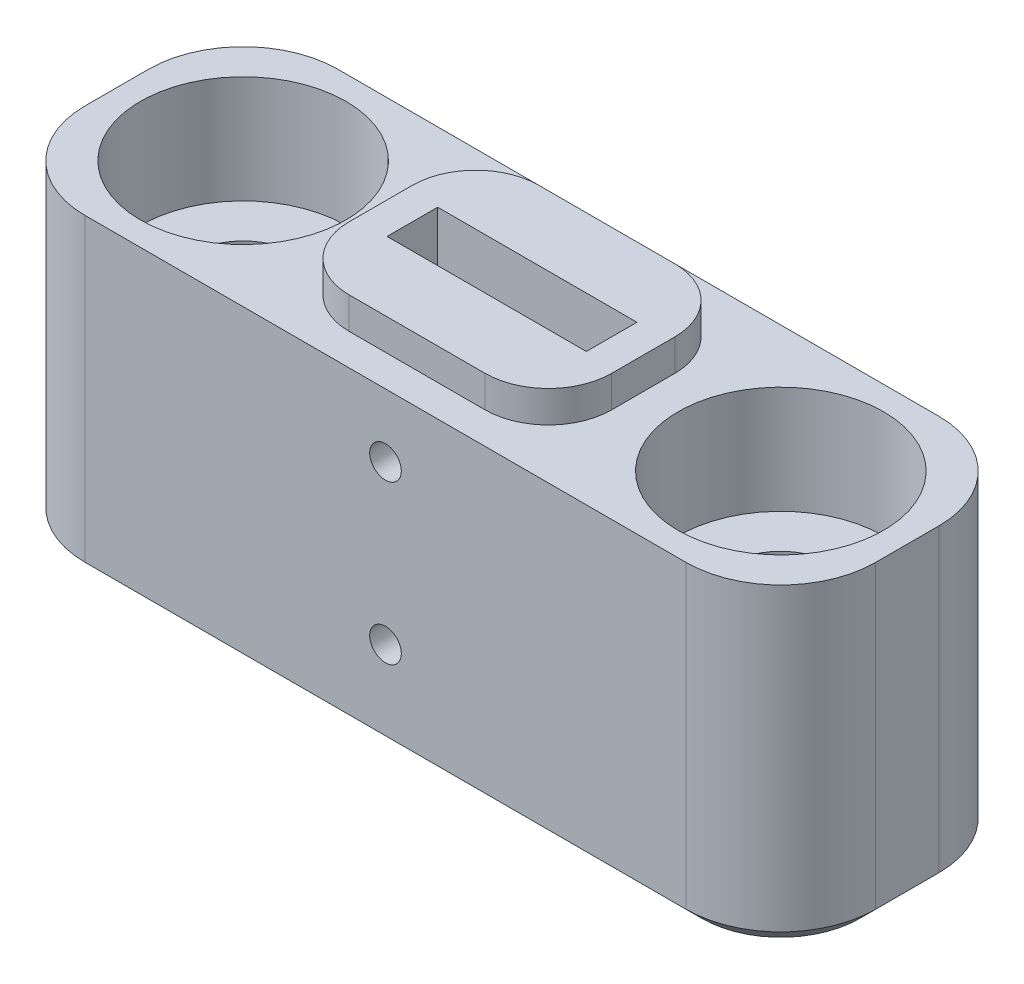
ISO-10303-21;
HEADER;
FILE_DESCRIPTION(('STEP AP214'),'2;1');
FILE_NAME('part.step','',(''),(''),'','','');
FILE_SCHEMA(('AUTOMOTIVE_DESIGN { 1 0 10303 214 1 1 1 1 }'));
ENDSEC;
DATA;
#1=APPLICATION_CONTEXT('core data for automotive mechanical design processes');
#2=APPLICATION_PROTOCOL_DEFINITION('international standard','automotive_design',2000,#1);
#3=PRODUCT_CONTEXT('',#1,'mechanical');
#4=PRODUCT('Part','Part','',(#3));
#5=PRODUCT_RELATED_PRODUCT_CATEGORY('part','',(#4));
#6=PRODUCT_DEFINITION_FORMATION('','',#4);
#7=PRODUCT_DEFINITION_CONTEXT('part definition',#1,'design');
#8=PRODUCT_DEFINITION('design','',#6,#7);
#9=PRODUCT_DEFINITION_SHAPE('','',#8);
#10=(LENGTH_UNIT() NAMED_UNIT(*) SI_UNIT(.MILLI.,.METRE.));
#11=(NAMED_UNIT(*) PLANE_ANGLE_UNIT() SI_UNIT($,.RADIAN.));
#12=(NAMED_UNIT(*) SI_UNIT($,.STERADIAN.) SOLID_ANGLE_UNIT());
#13=UNCERTAINTY_MEASURE_WITH_UNIT(LENGTH_MEASURE(1.E-05),#10,'distance_accuracy_value','');
#14=(GEOMETRIC_REPRESENTATION_CONTEXT(3) GLOBAL_UNCERTAINTY_ASSIGNED_CONTEXT((#13)) GLOBAL_UNIT_ASSIGNED_CONTEXT((#10,
#11,#12)) REPRESENTATION_CONTEXT('',''));
#15=CARTESIAN_POINT('',(0.,0.,0.));
#16=DIRECTION('',(0.,0.,1.));
#17=DIRECTION('',(1.,0.,0.));
#18=AXIS2_PLACEMENT_3D('',#15,#16,#17);
#19=CARTESIAN_POINT('',(12.5,5.,4.));
#20=DIRECTION('',(0.,-1.,0.));
#21=DIRECTION('',(1.,0.,0.));
#22=AXIS2_PLACEMENT_3D('',#19,#20,#21);
#23=PLANE('',#22);
#24=DIRECTION('',(0.,0.,-1.));
#25=VECTOR('',#24,1.);
#26=CARTESIAN_POINT('',(12.5,5.,4.));
#27=LINE('',#26,#25);
#28=CARTESIAN_POINT('',(12.5,5.,1.));
#29=VERTEX_POINT('',#28);
#30=CARTESIAN_POINT('',(12.5,5.,-1.));
#31=VERTEX_POINT('',#30);
#32=EDGE_CURVE('E302',#29,#31,#27,.T.);
#33=ORIENTED_EDGE('',*,*,#32,.T.);
#34=CARTESIAN_POINT('',(9.5,5.,-1.));
#35=DIRECTION('',(0.,-1.,0.));
#36=DIRECTION('',(1.,0.,0.));
#37=AXIS2_PLACEMENT_3D('',#34,#35,#36);
#38=CIRCLE('',#37,3.);
#39=CARTESIAN_POINT('',(9.5,5.,-4.));
#40=VERTEX_POINT('',#39);
#41=EDGE_CURVE('E316',#31,#40,#38,.F.);
#42=ORIENTED_EDGE('',*,*,#41,.T.);
#43=DIRECTION('',(-1.,0.,0.));
#44=VECTOR('',#43,1.);
#45=CARTESIAN_POINT('',(12.5,5.,-4.));
#46=LINE('',#45,#44);
#47=CARTESIAN_POINT('',(-9.5,5.,-4.));
#48=VERTEX_POINT('',#47);
#49=EDGE_CURVE('E293',#40,#48,#46,.T.);
#50=ORIENTED_EDGE('',*,*,#49,.T.);
#51=CARTESIAN_POINT('',(-9.5,5.,-1.));
#52=DIRECTION('',(0.,-1.,0.));
#53=DIRECTION('',(1.,0.,0.));
#54=AXIS2_PLACEMENT_3D('',#51,#52,#53);
#55=CIRCLE('',#54,3.);
#56=CARTESIAN_POINT('',(-12.5,5.,-1.));
#57=VERTEX_POINT('',#56);
#58=EDGE_CURVE('E312',#48,#57,#55,.F.);
#59=ORIENTED_EDGE('',*,*,#58,.T.);
#60=DIRECTION('',(0.,0.,-1.));
#61=VECTOR('',#60,1.);
#62=CARTESIAN_POINT('',(-12.5,5.,4.));
#63=LINE('',#62,#61);
#64=CARTESIAN_POINT('',(-12.5,5.,1.));
#65=VERTEX_POINT('',#64);
#66=EDGE_CURVE('E297',#65,#57,#63,.T.);
#67=ORIENTED_EDGE('',*,*,#66,.F.);
#68=CARTESIAN_POINT('',(-9.5,5.,1.));
#69=DIRECTION('',(0.,-1.,0.));
#70=DIRECTION('',(1.,0.,0.));
#71=AXIS2_PLACEMENT_3D('',#68,#69,#70);
#72=CIRCLE('',#71,3.);
#73=CARTESIAN_POINT('',(-9.5,5.,4.));
#74=VERTEX_POINT('',#73);
#75=EDGE_CURVE('E310',#65,#74,#72,.F.);
#76=ORIENTED_EDGE('',*,*,#75,.T.);
#77=DIRECTION('',(-1.,0.,0.));
#78=VECTOR('',#77,1.);
#79=CARTESIAN_POINT('',(12.5,5.,4.));
#80=LINE('',#79,#78);
#81=CARTESIAN_POINT('',(9.5,5.,4.));
#82=VERTEX_POINT('',#81);
#83=EDGE_CURVE('E294',#82,#74,#80,.T.);
#84=ORIENTED_EDGE('',*,*,#83,.F.);
#85=CARTESIAN_POINT('',(9.5,5.,1.));
#86=DIRECTION('',(0.,-1.,0.));
#87=DIRECTION('',(1.,0.,0.));
#88=AXIS2_PLACEMENT_3D('',#85,#86,#87);
#89=CIRCLE('',#88,3.);
#90=EDGE_CURVE('E314',#82,#29,#89,.F.);
#91=ORIENTED_EDGE('',*,*,#90,.T.);
#92=EDGE_LOOP('',(#33,#42,#50,#59,#67,#76,#84,#91));
#93=FACE_BOUND('',#92,.T.);
#94=CARTESIAN_POINT('',(8.5,5.,0.));
#95=DIRECTION('',(0.,1.,0.));
#96=DIRECTION('',(0.,0.,1.));
#97=AXIS2_PLACEMENT_3D('',#94,#95,#96);
#98=CIRCLE('',#97,3.25);
#99=CARTESIAN_POINT('',(8.5,5.,3.25));
#100=VERTEX_POINT('',#99);
#101=EDGE_CURVE('E281',#100,#100,#98,.T.);
#102=ORIENTED_EDGE('',*,*,#101,.F.);
#103=EDGE_LOOP('',(#102));
#104=FACE_BOUND('',#103,.T.);
#105=CARTESIAN_POINT('',(-8.5,5.,0.));
#106=DIRECTION('',(0.,1.,0.));
#107=DIRECTION('',(0.,0.,1.));
#108=AXIS2_PLACEMENT_3D('',#105,#106,#107);
#109=CIRCLE('',#108,3.25);
#110=CARTESIAN_POINT('',(-8.5,5.,3.24999999999999));
#111=VERTEX_POINT('',#110);
#112=EDGE_CURVE('E269',#111,#111,#109,.T.);
#113=ORIENTED_EDGE('',*,*,#112,.F.);
#114=EDGE_LOOP('',(#113));
#115=FACE_BOUND('',#114,.T.);
#116=DIRECTION('',(0.,0.,1.));
#117=VECTOR('',#116,1.);
#118=CARTESIAN_POINT('',(-4.15,5.,3.));
#119=LINE('',#118,#117);
#120=CARTESIAN_POINT('',(-4.15,5.,-1.));
#121=VERTEX_POINT('',#120);
#122=CARTESIAN_POINT('',(-4.15,5.,1.));
#123=VERTEX_POINT('',#122);
#124=EDGE_CURVE('E234',#121,#123,#119,.T.);
#125=ORIENTED_EDGE('',*,*,#124,.F.);
#126=CARTESIAN_POINT('',(-2.15,5.,-1.));
#127=DIRECTION('',(0.,-1.,0.));
#128=DIRECTION('',(1.,0.,0.));
#129=AXIS2_PLACEMENT_3D('',#126,#127,#128);
#130=CIRCLE('',#129,2.);
#131=CARTESIAN_POINT('',(-2.15,5.,-3.));
#132=VERTEX_POINT('',#131);
#133=EDGE_CURVE('E360',#121,#132,#130,.T.);
#134=ORIENTED_EDGE('',*,*,#133,.T.);
#135=DIRECTION('',(-1.,0.,0.));
#136=VECTOR('',#135,1.);
#137=CARTESIAN_POINT('',(4.15,5.,-3.));
#138=LINE('',#137,#136);
#139=CARTESIAN_POINT('',(2.15,5.,-3.));
#140=VERTEX_POINT('',#139);
#141=EDGE_CURVE('E239',#140,#132,#138,.T.);
#142=ORIENTED_EDGE('',*,*,#141,.F.);
#143=CARTESIAN_POINT('',(2.15,5.,-1.));
#144=DIRECTION('',(0.,-1.,0.));
#145=DIRECTION('',(1.,0.,0.));
#146=AXIS2_PLACEMENT_3D('',#143,#144,#145);
#147=CIRCLE('',#146,2.);
#148=CARTESIAN_POINT('',(4.15,5.,-1.));
#149=VERTEX_POINT('',#148);
#150=EDGE_CURVE('E362',#140,#149,#147,.T.);
#151=ORIENTED_EDGE('',*,*,#150,.T.);
#152=DIRECTION('',(0.,0.,-1.));
#153=VECTOR('',#152,1.);
#154=CARTESIAN_POINT('',(4.15,5.,3.));
#155=LINE('',#154,#153);
#156=CARTESIAN_POINT('',(4.15,5.,1.));
#157=VERTEX_POINT('',#156);
#158=EDGE_CURVE('E254',#157,#149,#155,.T.);
#159=ORIENTED_EDGE('',*,*,#158,.F.);
#160=CARTESIAN_POINT('',(2.15,5.,1.));
#161=DIRECTION('',(0.,-1.,0.));
#162=DIRECTION('',(1.,0.,0.));
#163=AXIS2_PLACEMENT_3D('',#160,#161,#162);
#164=CIRCLE('',#163,2.);
#165=CARTESIAN_POINT('',(2.15,5.,3.));
#166=VERTEX_POINT('',#165);
#167=EDGE_CURVE('E364',#157,#166,#164,.T.);
#168=ORIENTED_EDGE('',*,*,#167,.T.);
#169=DIRECTION('',(1.,0.,0.));
#170=VECTOR('',#169,1.);
#171=CARTESIAN_POINT('',(4.15,5.,3.));
#172=LINE('',#171,#170);
#173=CARTESIAN_POINT('',(-2.15,5.,3.));
#174=VERTEX_POINT('',#173);
#175=EDGE_CURVE('E251',#174,#166,#172,.T.);
#176=ORIENTED_EDGE('',*,*,#175,.F.);
#177=CARTESIAN_POINT('',(-2.15,5.,1.));
#178=DIRECTION('',(0.,-1.,0.));
#179=DIRECTION('',(1.,0.,0.));
#180=AXIS2_PLACEMENT_3D('',#177,#178,#179);
#181=CIRCLE('',#180,2.);
#182=EDGE_CURVE('E366',#174,#123,#181,.T.);
#183=ORIENTED_EDGE('',*,*,#182,.T.);
#184=EDGE_LOOP('',(#125,#134,#142,#151,#159,#168,#176,#183));
#185=FACE_BOUND('',#184,.T.);
#186=ADVANCED_FACE('F38',(#93,#104,#115,#185),#23,.F.);
#187=CARTESIAN_POINT('',(-12.5,-5.,4.));
#188=DIRECTION('',(1.,0.,0.));
#189=DIRECTION('',(0.,0.,-1.));
#190=AXIS2_PLACEMENT_3D('',#187,#188,#189);
#191=PLANE('',#190);
#192=DIRECTION('',(0.,-1.,0.));
#193=VECTOR('',#192,1.);
#194=CARTESIAN_POINT('',(-12.5,-5.,-1.));
#195=LINE('',#194,#193);
#196=CARTESIAN_POINT('',(-12.5,-4.50000000000001,-1.));
#197=VERTEX_POINT('',#196);
#198=EDGE_CURVE('E329',#57,#197,#195,.T.);
#199=ORIENTED_EDGE('',*,*,#198,.T.);
#200=DIRECTION('',(0.,0.,1.));
#201=VECTOR('',#200,1.);
#202=CARTESIAN_POINT('',(-12.5,-4.50000000000001,4.));
#203=LINE('',#202,#201);
#204=CARTESIAN_POINT('',(-12.5,-4.50000000000001,1.));
#205=VERTEX_POINT('',#204);
#206=EDGE_CURVE('E400',#197,#205,#203,.T.);
#207=ORIENTED_EDGE('',*,*,#206,.T.);
#208=DIRECTION('',(0.,-1.,0.));
#209=VECTOR('',#208,1.);
#210=CARTESIAN_POINT('',(-12.5,5.,1.));
#211=LINE('',#210,#209);
#212=EDGE_CURVE('E327',#205,#65,#211,.F.);
#213=ORIENTED_EDGE('',*,*,#212,.T.);
#214=ORIENTED_EDGE('',*,*,#66,.T.);
#215=EDGE_LOOP('',(#199,#207,#213,#214));
#216=FACE_BOUND('',#215,.T.);
#217=ADVANCED_FACE('F467',(#216),#191,.F.);
#218=CARTESIAN_POINT('',(12.5,-5.,4.));
#219=DIRECTION('',(0.,1.,0.));
#220=DIRECTION('',(-1.,0.,0.));
#221=AXIS2_PLACEMENT_3D('',#218,#219,#220);
#222=PLANE('',#221);
#223=CARTESIAN_POINT('',(-9.5,-5.,-1.));
#224=DIRECTION('',(0.,1.,0.));
#225=DIRECTION('',(-1.,0.,0.));
#226=AXIS2_PLACEMENT_3D('',#223,#224,#225);
#227=CIRCLE('',#226,2.5);
#228=CARTESIAN_POINT('',(-12.,-5.,-1.));
#229=VERTEX_POINT('',#228);
#230=CARTESIAN_POINT('',(-9.5,-5.,-3.5));
#231=VERTEX_POINT('',#230);
#232=EDGE_CURVE('E388',#229,#231,#227,.F.);
#233=ORIENTED_EDGE('',*,*,#232,.T.);
#234=DIRECTION('',(1.,0.,0.));
#235=VECTOR('',#234,1.);
#236=CARTESIAN_POINT('',(12.5,-5.,-3.5));
#237=LINE('',#236,#235);
#238=CARTESIAN_POINT('',(9.5,-5.,-3.5));
#239=VERTEX_POINT('',#238);
#240=EDGE_CURVE('E390',#231,#239,#237,.T.);
#241=ORIENTED_EDGE('',*,*,#240,.T.);
#242=CARTESIAN_POINT('',(9.5,-5.,-1.));
#243=DIRECTION('',(0.,1.,0.));
#244=DIRECTION('',(-1.,0.,0.));
#245=AXIS2_PLACEMENT_3D('',#242,#243,#244);
#246=CIRCLE('',#245,2.5);
#247=CARTESIAN_POINT('',(12.,-5.,-1.));
#248=VERTEX_POINT('',#247);
#249=EDGE_CURVE('E386',#239,#248,#246,.F.);
#250=ORIENTED_EDGE('',*,*,#249,.T.);
#251=DIRECTION('',(0.,0.,1.));
#252=VECTOR('',#251,1.);
#253=CARTESIAN_POINT('',(12.,-5.,4.));
#254=LINE('',#253,#252);
#255=CARTESIAN_POINT('',(12.,-5.,1.));
#256=VERTEX_POINT('',#255);
#257=EDGE_CURVE('E382',#248,#256,#254,.T.);
#258=ORIENTED_EDGE('',*,*,#257,.T.);
#259=CARTESIAN_POINT('',(9.5,-5.,1.));
#260=DIRECTION('',(0.,1.,0.));
#261=DIRECTION('',(-1.,0.,0.));
#262=AXIS2_PLACEMENT_3D('',#259,#260,#261);
#263=CIRCLE('',#262,2.5);
#264=CARTESIAN_POINT('',(9.5,-5.,3.5));
#265=VERTEX_POINT('',#264);
#266=EDGE_CURVE('E378',#256,#265,#263,.F.);
#267=ORIENTED_EDGE('',*,*,#266,.T.);
#268=DIRECTION('',(-1.,0.,0.));
#269=VECTOR('',#268,1.);
#270=CARTESIAN_POINT('',(-9.5,-5.,3.5));
#271=LINE('',#270,#269);
#272=CARTESIAN_POINT('',(-9.5,-5.,3.5));
#273=VERTEX_POINT('',#272);
#274=EDGE_CURVE('E368',#265,#273,#271,.T.);
#275=ORIENTED_EDGE('',*,*,#274,.T.);
#276=CARTESIAN_POINT('',(-9.5,-5.,1.));
#277=DIRECTION('',(0.,1.,0.));
#278=DIRECTION('',(-1.,0.,0.));
#279=AXIS2_PLACEMENT_3D('',#276,#277,#278);
#280=CIRCLE('',#279,2.5);
#281=CARTESIAN_POINT('',(-12.,-5.,1.));
#282=VERTEX_POINT('',#281);
#283=EDGE_CURVE('E380',#273,#282,#280,.F.);
#284=ORIENTED_EDGE('',*,*,#283,.T.);
#285=DIRECTION('',(0.,0.,-1.));
#286=VECTOR('',#285,1.);
#287=CARTESIAN_POINT('',(-12.,-5.,4.));
#288=LINE('',#287,#286);
#289=EDGE_CURVE('E384',#282,#229,#288,.T.);
#290=ORIENTED_EDGE('',*,*,#289,.T.);
#291=EDGE_LOOP('',(#233,#241,#250,#258,#267,#275,#284,#290));
#292=FACE_BOUND('',#291,.T.);
#293=CARTESIAN_POINT('',(-8.5,-5.00000000000001,0.));
#294=DIRECTION('',(0.,1.,0.));
#295=DIRECTION('',(0.,0.,1.));
#296=AXIS2_PLACEMENT_3D('',#293,#294,#295);
#297=CIRCLE('',#296,1.7);
#298=CARTESIAN_POINT('',(-8.5,-5.00000000000001,1.7));
#299=VERTEX_POINT('',#298);
#300=EDGE_CURVE('E278',#299,#299,#297,.T.);
#301=ORIENTED_EDGE('',*,*,#300,.T.);
#302=EDGE_LOOP('',(#301));
#303=FACE_BOUND('',#302,.T.);
#304=CARTESIAN_POINT('',(8.5,-5.,0.));
#305=DIRECTION('',(0.,1.,0.));
#306=DIRECTION('',(0.,0.,1.));
#307=AXIS2_PLACEMENT_3D('',#304,#305,#306);
#308=CIRCLE('',#307,1.7);
#309=CARTESIAN_POINT('',(8.5,-5.,1.7));
#310=VERTEX_POINT('',#309);
#311=EDGE_CURVE('E290',#310,#310,#308,.T.);
#312=ORIENTED_EDGE('',*,*,#311,.T.);
#313=EDGE_LOOP('',(#312));
#314=FACE_BOUND('',#313,.T.);
#315=ADVANCED_FACE('F473',(#292,#303,#314),#222,.F.);
#316=CARTESIAN_POINT('',(12.5,-5.,4.));
#317=DIRECTION('',(-1.,0.,0.));
#318=DIRECTION('',(0.,0.,1.));
#319=AXIS2_PLACEMENT_3D('',#316,#317,#318);
#320=PLANE('',#319);
#321=DIRECTION('',(0.,1.,0.));
#322=VECTOR('',#321,1.);
#323=CARTESIAN_POINT('',(12.5,-5.,1.));
#324=LINE('',#323,#322);
#325=CARTESIAN_POINT('',(12.5,-4.50000000000001,1.));
#326=VERTEX_POINT('',#325);
#327=EDGE_CURVE('E305',#29,#326,#324,.F.);
#328=ORIENTED_EDGE('',*,*,#327,.T.);
#329=DIRECTION('',(0.,0.,-1.));
#330=VECTOR('',#329,1.);
#331=CARTESIAN_POINT('',(12.5,-4.50000000000001,4.));
#332=LINE('',#331,#330);
#333=CARTESIAN_POINT('',(12.5,-4.50000000000001,-1.));
#334=VERTEX_POINT('',#333);
#335=EDGE_CURVE('E402',#326,#334,#332,.T.);
#336=ORIENTED_EDGE('',*,*,#335,.T.);
#337=DIRECTION('',(0.,1.,0.));
#338=VECTOR('',#337,1.);
#339=CARTESIAN_POINT('',(12.5,-5.,-1.));
#340=LINE('',#339,#338);
#341=EDGE_CURVE('E308',#334,#31,#340,.T.);
#342=ORIENTED_EDGE('',*,*,#341,.T.);
#343=ORIENTED_EDGE('',*,*,#32,.F.);
#344=EDGE_LOOP('',(#328,#336,#342,#343));
#345=FACE_BOUND('',#344,.T.);
#346=ADVANCED_FACE('F481',(#345),#320,.F.);
#347=CARTESIAN_POINT('',(0.,0.,4.));
#348=DIRECTION('',(0.,0.,1.));
#349=DIRECTION('',(1.,0.,0.));
#350=AXIS2_PLACEMENT_3D('',#347,#348,#349);
#351=PLANE('',#350);
#352=CARTESIAN_POINT('',(0.,3.,4.));
#353=DIRECTION('',(0.,0.,1.));
#354=DIRECTION('',(1.,0.,0.));
#355=AXIS2_PLACEMENT_3D('',#352,#353,#354);
#356=CIRCLE('',#355,0.5);
#357=CARTESIAN_POINT('',(0.5,3.,4.));
#358=VERTEX_POINT('',#357);
#359=EDGE_CURVE('E438',#358,#358,#356,.T.);
#360=ORIENTED_EDGE('',*,*,#359,.F.);
#361=EDGE_LOOP('',(#360));
#362=FACE_BOUND('',#361,.T.);
#363=CARTESIAN_POINT('',(0.,-2.,4.));
#364=DIRECTION('',(0.,0.,1.));
#365=DIRECTION('',(1.,0.,0.));
#366=AXIS2_PLACEMENT_3D('',#363,#364,#365);
#367=CIRCLE('',#366,0.5);
#368=CARTESIAN_POINT('',(0.5,-2.,4.));
#369=VERTEX_POINT('',#368);
#370=EDGE_CURVE('E428',#369,#369,#367,.T.);
#371=ORIENTED_EDGE('',*,*,#370,.F.);
#372=EDGE_LOOP('',(#371));
#373=FACE_BOUND('',#372,.T.);
#374=DIRECTION('',(0.,-1.,0.));
#375=VECTOR('',#374,1.);
#376=CARTESIAN_POINT('',(-9.5,-5.,4.));
#377=LINE('',#376,#375);
#378=CARTESIAN_POINT('',(-9.5,-4.50000000000001,4.));
#379=VERTEX_POINT('',#378);
#380=EDGE_CURVE('E323',#74,#379,#377,.T.);
#381=ORIENTED_EDGE('',*,*,#380,.T.);
#382=DIRECTION('',(1.,0.,0.));
#383=VECTOR('',#382,1.);
#384=CARTESIAN_POINT('',(9.5,-4.50000000000001,4.));
#385=LINE('',#384,#383);
#386=CARTESIAN_POINT('',(9.5,-4.50000000000001,4.));
#387=VERTEX_POINT('',#386);
#388=EDGE_CURVE('E12',#379,#387,#385,.T.);
#389=ORIENTED_EDGE('',*,*,#388,.T.);
#390=DIRECTION('',(0.,1.,0.));
#391=VECTOR('',#390,1.);
#392=CARTESIAN_POINT('',(9.5,5.,4.));
#393=LINE('',#392,#391);
#394=EDGE_CURVE('E325',#387,#82,#393,.T.);
#395=ORIENTED_EDGE('',*,*,#394,.T.);
#396=ORIENTED_EDGE('',*,*,#83,.T.);
#397=EDGE_LOOP('',(#381,#389,#395,#396));
#398=FACE_BOUND('',#397,.T.);
#399=ADVANCED_FACE('F484',(#362,#373,#398),#351,.T.);
#400=CARTESIAN_POINT('',(0.,0.,-4.));
#401=DIRECTION('',(0.,0.,1.));
#402=DIRECTION('',(1.,0.,0.));
#403=AXIS2_PLACEMENT_3D('',#400,#401,#402);
#404=PLANE('',#403);
#405=CARTESIAN_POINT('',(0.,3.,-4.));
#406=DIRECTION('',(0.,0.,1.));
#407=DIRECTION('',(1.,0.,0.));
#408=AXIS2_PLACEMENT_3D('',#405,#406,#407);
#409=CIRCLE('',#408,0.5);
#410=CARTESIAN_POINT('',(0.5,3.,-4.));
#411=VERTEX_POINT('',#410);
#412=EDGE_CURVE('E373',#411,#411,#409,.T.);
#413=ORIENTED_EDGE('',*,*,#412,.T.);
#414=EDGE_LOOP('',(#413));
#415=FACE_BOUND('',#414,.T.);
#416=CARTESIAN_POINT('',(0.,-2.,-4.));
#417=DIRECTION('',(0.,0.,1.));
#418=DIRECTION('',(1.,0.,0.));
#419=AXIS2_PLACEMENT_3D('',#416,#417,#418);
#420=CIRCLE('',#419,0.5);
#421=CARTESIAN_POINT('',(0.5,-2.,-4.));
#422=VERTEX_POINT('',#421);
#423=EDGE_CURVE('E433',#422,#422,#420,.T.);
#424=ORIENTED_EDGE('',*,*,#423,.T.);
#425=EDGE_LOOP('',(#424));
#426=FACE_BOUND('',#425,.T.);
#427=DIRECTION('',(0.,1.,0.));
#428=VECTOR('',#427,1.);
#429=CARTESIAN_POINT('',(9.5,0.,-4.));
#430=LINE('',#429,#428);
#431=CARTESIAN_POINT('',(9.5,-4.50000000000001,-4.));
#432=VERTEX_POINT('',#431);
#433=EDGE_CURVE('E320',#40,#432,#430,.F.);
#434=ORIENTED_EDGE('',*,*,#433,.T.);
#435=DIRECTION('',(-1.,0.,0.));
#436=VECTOR('',#435,1.);
#437=CARTESIAN_POINT('',(0.,-4.50000000000001,-4.));
#438=LINE('',#437,#436);
#439=CARTESIAN_POINT('',(-9.5,-4.50000000000001,-4.));
#440=VERTEX_POINT('',#439);
#441=EDGE_CURVE('E393',#432,#440,#438,.T.);
#442=ORIENTED_EDGE('',*,*,#441,.T.);
#443=DIRECTION('',(0.,-1.,0.));
#444=VECTOR('',#443,1.);
#445=CARTESIAN_POINT('',(-9.5,0.,-4.));
#446=LINE('',#445,#444);
#447=EDGE_CURVE('E318',#440,#48,#446,.F.);
#448=ORIENTED_EDGE('',*,*,#447,.T.);
#449=ORIENTED_EDGE('',*,*,#49,.F.);
#450=EDGE_LOOP('',(#434,#442,#448,#449));
#451=FACE_BOUND('',#450,.T.);
#452=ADVANCED_FACE('F479',(#415,#426,#451),#404,.F.);
#453=CARTESIAN_POINT('',(8.5,5.,0.));
#454=DIRECTION('',(0.,1.,0.));
#455=DIRECTION('',(0.,0.,1.));
#456=AXIS2_PLACEMENT_3D('',#453,#454,#455);
#457=CYLINDRICAL_SURFACE('',#456,1.7);
#458=ORIENTED_EDGE('',*,*,#311,.F.);
#459=EDGE_LOOP('',(#458));
#460=FACE_BOUND('',#459,.T.);
#461=CARTESIAN_POINT('',(8.5,1.6,0.));
#462=DIRECTION('',(0.,1.,0.));
#463=DIRECTION('',(0.,0.,1.));
#464=AXIS2_PLACEMENT_3D('',#461,#462,#463);
#465=CIRCLE('',#464,1.70000000000001);
#466=CARTESIAN_POINT('',(8.5,1.6,1.70000000000001));
#467=VERTEX_POINT('',#466);
#468=EDGE_CURVE('E287',#467,#467,#465,.T.);
#469=ORIENTED_EDGE('',*,*,#468,.T.);
#470=EDGE_LOOP('',(#469));
#471=FACE_BOUND('',#470,.T.);
#472=ADVANCED_FACE('F804',(#460,#471),#457,.F.);
#473=CARTESIAN_POINT('',(10.2,1.6,0.));
#474=DIRECTION('',(0.,-1.,0.));
#475=DIRECTION('',(0.,0.,-1.));
#476=AXIS2_PLACEMENT_3D('',#473,#474,#475);
#477=PLANE('',#476);
#478=ORIENTED_EDGE('',*,*,#468,.F.);
#479=EDGE_LOOP('',(#478));
#480=FACE_BOUND('',#479,.T.);
#481=CARTESIAN_POINT('',(8.5,1.6,0.));
#482=DIRECTION('',(0.,1.,0.));
#483=DIRECTION('',(0.,0.,1.));
#484=AXIS2_PLACEMENT_3D('',#481,#482,#483);
#485=CIRCLE('',#484,3.25);
#486=CARTESIAN_POINT('',(8.5,1.6,3.25));
#487=VERTEX_POINT('',#486);
#488=EDGE_CURVE('E284',#487,#487,#485,.T.);
#489=ORIENTED_EDGE('',*,*,#488,.T.);
#490=EDGE_LOOP('',(#489));
#491=FACE_BOUND('',#490,.T.);
#492=ADVANCED_FACE('F794',(#480,#491),#477,.F.);
#493=CARTESIAN_POINT('',(8.5,5.,0.));
#494=DIRECTION('',(0.,1.,0.));
#495=DIRECTION('',(0.,0.,1.));
#496=AXIS2_PLACEMENT_3D('',#493,#494,#495);
#497=CYLINDRICAL_SURFACE('',#496,3.25);
#498=ORIENTED_EDGE('',*,*,#488,.F.);
#499=EDGE_LOOP('',(#498));
#500=FACE_BOUND('',#499,.T.);
#501=ORIENTED_EDGE('',*,*,#101,.T.);
#502=EDGE_LOOP('',(#501));
#503=FACE_BOUND('',#502,.T.);
#504=ADVANCED_FACE('F784',(#500,#503),#497,.F.);
#505=CARTESIAN_POINT('',(-8.5,5.,0.));
#506=DIRECTION('',(0.,1.,0.));
#507=DIRECTION('',(0.,0.,1.));
#508=AXIS2_PLACEMENT_3D('',#505,#506,#507);
#509=CYLINDRICAL_SURFACE('',#508,1.7);
#510=ORIENTED_EDGE('',*,*,#300,.F.);
#511=EDGE_LOOP('',(#510));
#512=FACE_BOUND('',#511,.T.);
#513=CARTESIAN_POINT('',(-8.5,1.6,0.));
#514=DIRECTION('',(0.,1.,0.));
#515=DIRECTION('',(0.,0.,1.));
#516=AXIS2_PLACEMENT_3D('',#513,#514,#515);
#517=CIRCLE('',#516,1.70000000000001);
#518=CARTESIAN_POINT('',(-8.5,1.6,1.70000000000001));
#519=VERTEX_POINT('',#518);
#520=EDGE_CURVE('E275',#519,#519,#517,.T.);
#521=ORIENTED_EDGE('',*,*,#520,.T.);
#522=EDGE_LOOP('',(#521));
#523=FACE_BOUND('',#522,.T.);
#524=ADVANCED_FACE('F774',(#512,#523),#509,.F.);
#525=CARTESIAN_POINT('',(-6.79999999999999,1.6,0.));
#526=DIRECTION('',(0.,-1.,0.));
#527=DIRECTION('',(0.,0.,-1.));
#528=AXIS2_PLACEMENT_3D('',#525,#526,#527);
#529=PLANE('',#528);
#530=ORIENTED_EDGE('',*,*,#520,.F.);
#531=EDGE_LOOP('',(#530));
#532=FACE_BOUND('',#531,.T.);
#533=CARTESIAN_POINT('',(-8.5,1.6,0.));
#534=DIRECTION('',(0.,1.,0.));
#535=DIRECTION('',(0.,0.,1.));
#536=AXIS2_PLACEMENT_3D('',#533,#534,#535);
#537=CIRCLE('',#536,3.25);
#538=CARTESIAN_POINT('',(-8.5,1.6,3.24999999999999));
#539=VERTEX_POINT('',#538);
#540=EDGE_CURVE('E272',#539,#539,#537,.T.);
#541=ORIENTED_EDGE('',*,*,#540,.T.);
#542=EDGE_LOOP('',(#541));
#543=FACE_BOUND('',#542,.T.);
#544=ADVANCED_FACE('F763',(#532,#543),#529,.F.);
#545=CARTESIAN_POINT('',(-8.5,5.,0.));
#546=DIRECTION('',(0.,1.,0.));
#547=DIRECTION('',(0.,0.,1.));
#548=AXIS2_PLACEMENT_3D('',#545,#546,#547);
#549=CYLINDRICAL_SURFACE('',#548,3.25);
#550=ORIENTED_EDGE('',*,*,#540,.F.);
#551=EDGE_LOOP('',(#550));
#552=FACE_BOUND('',#551,.T.);
#553=ORIENTED_EDGE('',*,*,#112,.T.);
#554=EDGE_LOOP('',(#553));
#555=FACE_BOUND('',#554,.T.);
#556=ADVANCED_FACE('F493',(#552,#555),#549,.F.);
#557=CARTESIAN_POINT('',(9.5,-5.,-1.));
#558=DIRECTION('',(0.,1.,0.));
#559=DIRECTION('',(0.,0.,1.));
#560=AXIS2_PLACEMENT_3D('',#557,#558,#559);
#561=CYLINDRICAL_SURFACE('',#560,3.);
#562=ORIENTED_EDGE('',*,*,#341,.F.);
#563=CARTESIAN_POINT('',(9.5,-4.50000000000001,-1.));
#564=DIRECTION('',(0.,1.,0.));
#565=DIRECTION('',(0.,0.,1.));
#566=AXIS2_PLACEMENT_3D('',#563,#564,#565);
#567=CIRCLE('',#566,3.);
#568=EDGE_CURVE('E398',#334,#432,#567,.T.);
#569=ORIENTED_EDGE('',*,*,#568,.T.);
#570=ORIENTED_EDGE('',*,*,#433,.F.);
#571=ORIENTED_EDGE('',*,*,#41,.F.);
#572=EDGE_LOOP('',(#562,#569,#570,#571));
#573=FACE_BOUND('',#572,.T.);
#574=ADVANCED_FACE('F489',(#573),#561,.T.);
#575=CARTESIAN_POINT('',(9.5,0.,1.));
#576=DIRECTION('',(0.,-1.,0.));
#577=DIRECTION('',(0.,0.,-1.));
#578=AXIS2_PLACEMENT_3D('',#575,#576,#577);
#579=CYLINDRICAL_SURFACE('',#578,3.);
#580=ORIENTED_EDGE('',*,*,#394,.F.);
#581=CARTESIAN_POINT('',(9.5,-4.50000000000001,1.));
#582=DIRECTION('',(0.,1.,0.));
#583=DIRECTION('',(0.,0.,1.));
#584=AXIS2_PLACEMENT_3D('',#581,#582,#583);
#585=CIRCLE('',#584,3.);
#586=EDGE_CURVE('E48',#387,#326,#585,.T.);
#587=ORIENTED_EDGE('',*,*,#586,.T.);
#588=ORIENTED_EDGE('',*,*,#327,.F.);
#589=ORIENTED_EDGE('',*,*,#90,.F.);
#590=EDGE_LOOP('',(#580,#587,#588,#589));
#591=FACE_BOUND('',#590,.T.);
#592=ADVANCED_FACE('F492',(#591),#579,.T.);
#593=CARTESIAN_POINT('',(-9.5,-5.,-1.));
#594=DIRECTION('',(0.,-1.,0.));
#595=DIRECTION('',(0.,0.,-1.));
#596=AXIS2_PLACEMENT_3D('',#593,#594,#595);
#597=CYLINDRICAL_SURFACE('',#596,3.);
#598=ORIENTED_EDGE('',*,*,#447,.F.);
#599=CARTESIAN_POINT('',(-9.5,-4.50000000000001,-1.));
#600=DIRECTION('',(0.,1.,0.));
#601=DIRECTION('',(0.,0.,1.));
#602=AXIS2_PLACEMENT_3D('',#599,#600,#601);
#603=CIRCLE('',#602,3.);
#604=EDGE_CURVE('E396',#440,#197,#603,.T.);
#605=ORIENTED_EDGE('',*,*,#604,.T.);
#606=ORIENTED_EDGE('',*,*,#198,.F.);
#607=ORIENTED_EDGE('',*,*,#58,.F.);
#608=EDGE_LOOP('',(#598,#605,#606,#607));
#609=FACE_BOUND('',#608,.T.);
#610=ADVANCED_FACE('F497',(#609),#597,.T.);
#611=CARTESIAN_POINT('',(-9.5,0.,1.));
#612=DIRECTION('',(0.,1.,0.));
#613=DIRECTION('',(0.,0.,1.));
#614=AXIS2_PLACEMENT_3D('',#611,#612,#613);
#615=CYLINDRICAL_SURFACE('',#614,3.);
#616=ORIENTED_EDGE('',*,*,#212,.F.);
#617=CARTESIAN_POINT('',(-9.5,-4.50000000000001,1.));
#618=DIRECTION('',(0.,1.,0.));
#619=DIRECTION('',(0.,0.,1.));
#620=AXIS2_PLACEMENT_3D('',#617,#618,#619);
#621=CIRCLE('',#620,3.);
#622=EDGE_CURVE('E62',#205,#379,#621,.T.);
#623=ORIENTED_EDGE('',*,*,#622,.T.);
#624=ORIENTED_EDGE('',*,*,#380,.F.);
#625=ORIENTED_EDGE('',*,*,#75,.F.);
#626=EDGE_LOOP('',(#616,#623,#624,#625));
#627=FACE_BOUND('',#626,.T.);
#628=ADVANCED_FACE('F501',(#627),#615,.T.);
#629=CARTESIAN_POINT('',(0.,6.,0.));
#630=DIRECTION('',(0.,1.,0.));
#631=DIRECTION('',(0.,0.,1.));
#632=AXIS2_PLACEMENT_3D('',#629,#630,#631);
#633=PLANE('',#632);
#634=DIRECTION('',(-1.,0.,0.));
#635=VECTOR('',#634,1.);
#636=CARTESIAN_POINT('',(4.15,6.,-3.));
#637=LINE('',#636,#635);
#638=CARTESIAN_POINT('',(2.15,6.,-3.));
#639=VERTEX_POINT('',#638);
#640=CARTESIAN_POINT('',(-2.15,6.,-3.));
#641=VERTEX_POINT('',#640);
#642=EDGE_CURVE('E245',#639,#641,#637,.T.);
#643=ORIENTED_EDGE('',*,*,#642,.T.);
#644=CARTESIAN_POINT('',(-2.15,6.,-1.));
#645=DIRECTION('',(0.,1.,0.));
#646=DIRECTION('',(0.,0.,1.));
#647=AXIS2_PLACEMENT_3D('',#644,#645,#646);
#648=CIRCLE('',#647,2.);
#649=CARTESIAN_POINT('',(-4.15,6.,-1.));
#650=VERTEX_POINT('',#649);
#651=EDGE_CURVE('E348',#641,#650,#648,.T.);
#652=ORIENTED_EDGE('',*,*,#651,.T.);
#653=DIRECTION('',(0.,0.,1.));
#654=VECTOR('',#653,1.);
#655=CARTESIAN_POINT('',(-4.15,6.,3.));
#656=LINE('',#655,#654);
#657=CARTESIAN_POINT('',(-4.15,6.,1.));
#658=VERTEX_POINT('',#657);
#659=EDGE_CURVE('E235',#650,#658,#656,.T.);
#660=ORIENTED_EDGE('',*,*,#659,.T.);
#661=CARTESIAN_POINT('',(-2.15,6.,1.));
#662=DIRECTION('',(0.,1.,0.));
#663=DIRECTION('',(0.,0.,1.));
#664=AXIS2_PLACEMENT_3D('',#661,#662,#663);
#665=CIRCLE('',#664,2.);
#666=CARTESIAN_POINT('',(-2.15,6.,3.));
#667=VERTEX_POINT('',#666);
#668=EDGE_CURVE('E342',#658,#667,#665,.T.);
#669=ORIENTED_EDGE('',*,*,#668,.T.);
#670=DIRECTION('',(1.,0.,0.));
#671=VECTOR('',#670,1.);
#672=CARTESIAN_POINT('',(4.15,6.,3.));
#673=LINE('',#672,#671);
#674=CARTESIAN_POINT('',(2.15,6.,3.));
#675=VERTEX_POINT('',#674);
#676=EDGE_CURVE('E238',#667,#675,#673,.T.);
#677=ORIENTED_EDGE('',*,*,#676,.T.);
#678=CARTESIAN_POINT('',(2.15,6.,1.));
#679=DIRECTION('',(0.,1.,0.));
#680=DIRECTION('',(0.,0.,1.));
#681=AXIS2_PLACEMENT_3D('',#678,#679,#680);
#682=CIRCLE('',#681,2.);
#683=CARTESIAN_POINT('',(4.15,6.,1.));
#684=VERTEX_POINT('',#683);
#685=EDGE_CURVE('E344',#675,#684,#682,.T.);
#686=ORIENTED_EDGE('',*,*,#685,.T.);
#687=DIRECTION('',(0.,0.,-1.));
#688=VECTOR('',#687,1.);
#689=CARTESIAN_POINT('',(4.15,6.,3.));
#690=LINE('',#689,#688);
#691=CARTESIAN_POINT('',(4.15,6.,-1.));
#692=VERTEX_POINT('',#691);
#693=EDGE_CURVE('E242',#684,#692,#690,.T.);
#694=ORIENTED_EDGE('',*,*,#693,.T.);
#695=CARTESIAN_POINT('',(2.15,6.,-1.));
#696=DIRECTION('',(0.,1.,0.));
#697=DIRECTION('',(0.,0.,1.));
#698=AXIS2_PLACEMENT_3D('',#695,#696,#697);
#699=CIRCLE('',#698,2.);
#700=EDGE_CURVE('E346',#692,#639,#699,.T.);
#701=ORIENTED_EDGE('',*,*,#700,.T.);
#702=EDGE_LOOP('',(#643,#652,#660,#669,#677,#686,#694,#701));
#703=FACE_BOUND('',#702,.T.);
#704=DIRECTION('',(0.,0.,1.));
#705=VECTOR('',#704,1.);
#706=CARTESIAN_POINT('',(-3.15,6.,-0.8));
#707=LINE('',#706,#705);
#708=CARTESIAN_POINT('',(-3.15,6.,-0.8));
#709=VERTEX_POINT('',#708);
#710=CARTESIAN_POINT('',(-3.15,6.,0.8));
#711=VERTEX_POINT('',#710);
#712=EDGE_CURVE('E207',#709,#711,#707,.T.);
#713=ORIENTED_EDGE('',*,*,#712,.F.);
#714=DIRECTION('',(-1.,0.,0.));
#715=VECTOR('',#714,1.);
#716=CARTESIAN_POINT('',(-3.15,6.,-0.8));
#717=LINE('',#716,#715);
#718=CARTESIAN_POINT('',(3.15,6.,-0.800000000000001));
#719=VERTEX_POINT('',#718);
#720=EDGE_CURVE('E217',#719,#709,#717,.T.);
#721=ORIENTED_EDGE('',*,*,#720,.F.);
#722=DIRECTION('',(0.,0.,-1.));
#723=VECTOR('',#722,1.);
#724=CARTESIAN_POINT('',(3.15,6.,-0.800000000000001));
#725=LINE('',#724,#723);
#726=CARTESIAN_POINT('',(3.15,6.,0.799999999999999));
#727=VERTEX_POINT('',#726);
#728=EDGE_CURVE('E229',#727,#719,#725,.T.);
#729=ORIENTED_EDGE('',*,*,#728,.F.);
#730=DIRECTION('',(1.,0.,0.));
#731=VECTOR('',#730,1.);
#732=CARTESIAN_POINT('',(-3.15,6.,0.8));
#733=LINE('',#732,#731);
#734=EDGE_CURVE('E227',#711,#727,#733,.T.);
#735=ORIENTED_EDGE('',*,*,#734,.F.);
#736=EDGE_LOOP('',(#713,#721,#729,#735));
#737=FACE_BOUND('',#736,.T.);
#738=ADVANCED_FACE('F225',(#703,#737),#633,.T.);
#739=CARTESIAN_POINT('',(-4.15,6.,3.));
#740=DIRECTION('',(1.,0.,0.));
#741=DIRECTION('',(0.,1.,0.));
#742=AXIS2_PLACEMENT_3D('',#739,#740,#741);
#743=PLANE('',#742);
#744=ORIENTED_EDGE('',*,*,#659,.F.);
#745=DIRECTION('',(0.,-1.,0.));
#746=VECTOR('',#745,1.);
#747=CARTESIAN_POINT('',(-4.15,6.,-1.));
#748=LINE('',#747,#746);
#749=EDGE_CURVE('E334',#650,#121,#748,.T.);
#750=ORIENTED_EDGE('',*,*,#749,.T.);
#751=ORIENTED_EDGE('',*,*,#124,.T.);
#752=DIRECTION('',(0.,-1.,0.));
#753=VECTOR('',#752,1.);
#754=CARTESIAN_POINT('',(-4.15,6.,1.));
#755=LINE('',#754,#753);
#756=EDGE_CURVE('E332',#123,#658,#755,.F.);
#757=ORIENTED_EDGE('',*,*,#756,.T.);
#758=EDGE_LOOP('',(#744,#750,#751,#757));
#759=FACE_BOUND('',#758,.T.);
#760=ADVANCED_FACE('F728',(#759),#743,.F.);
#761=CARTESIAN_POINT('',(4.15,6.,3.));
#762=DIRECTION('',(0.,0.,-1.));
#763=DIRECTION('',(-1.,0.,0.));
#764=AXIS2_PLACEMENT_3D('',#761,#762,#763);
#765=PLANE('',#764);
#766=ORIENTED_EDGE('',*,*,#175,.T.);
#767=DIRECTION('',(0.,-1.,0.));
#768=VECTOR('',#767,1.);
#769=CARTESIAN_POINT('',(2.15,6.,3.));
#770=LINE('',#769,#768);
#771=EDGE_CURVE('E358',#166,#675,#770,.F.);
#772=ORIENTED_EDGE('',*,*,#771,.T.);
#773=ORIENTED_EDGE('',*,*,#676,.F.);
#774=DIRECTION('',(0.,-1.,0.));
#775=VECTOR('',#774,1.);
#776=CARTESIAN_POINT('',(-2.15,6.,3.));
#777=LINE('',#776,#775);
#778=EDGE_CURVE('E355',#667,#174,#777,.T.);
#779=ORIENTED_EDGE('',*,*,#778,.T.);
#780=EDGE_LOOP('',(#766,#772,#773,#779));
#781=FACE_BOUND('',#780,.T.);
#782=ADVANCED_FACE('F719',(#781),#765,.F.);
#783=CARTESIAN_POINT('',(4.15,6.,3.));
#784=DIRECTION('',(-1.,0.,0.));
#785=DIRECTION('',(0.,-1.,0.));
#786=AXIS2_PLACEMENT_3D('',#783,#784,#785);
#787=PLANE('',#786);
#788=ORIENTED_EDGE('',*,*,#158,.T.);
#789=DIRECTION('',(0.,-1.,0.));
#790=VECTOR('',#789,1.);
#791=CARTESIAN_POINT('',(4.15,6.,-1.));
#792=LINE('',#791,#790);
#793=EDGE_CURVE('E353',#149,#692,#792,.F.);
#794=ORIENTED_EDGE('',*,*,#793,.T.);
#795=ORIENTED_EDGE('',*,*,#693,.F.);
#796=DIRECTION('',(0.,-1.,0.));
#797=VECTOR('',#796,1.);
#798=CARTESIAN_POINT('',(4.15,6.,1.));
#799=LINE('',#798,#797);
#800=EDGE_CURVE('E350',#684,#157,#799,.T.);
#801=ORIENTED_EDGE('',*,*,#800,.T.);
#802=EDGE_LOOP('',(#788,#794,#795,#801));
#803=FACE_BOUND('',#802,.T.);
#804=ADVANCED_FACE('F710',(#803),#787,.F.);
#805=CARTESIAN_POINT('',(4.15,6.,-3.));
#806=DIRECTION('',(0.,0.,1.));
#807=DIRECTION('',(1.,0.,0.));
#808=AXIS2_PLACEMENT_3D('',#805,#806,#807);
#809=PLANE('',#808);
#810=ORIENTED_EDGE('',*,*,#141,.T.);
#811=DIRECTION('',(0.,-1.,0.));
#812=VECTOR('',#811,1.);
#813=CARTESIAN_POINT('',(-2.15,6.,-3.));
#814=LINE('',#813,#812);
#815=EDGE_CURVE('E340',#132,#641,#814,.F.);
#816=ORIENTED_EDGE('',*,*,#815,.T.);
#817=ORIENTED_EDGE('',*,*,#642,.F.);
#818=DIRECTION('',(0.,-1.,0.));
#819=VECTOR('',#818,1.);
#820=CARTESIAN_POINT('',(2.15,6.,-3.));
#821=LINE('',#820,#819);
#822=EDGE_CURVE('E337',#639,#140,#821,.T.);
#823=ORIENTED_EDGE('',*,*,#822,.T.);
#824=EDGE_LOOP('',(#810,#816,#817,#823));
#825=FACE_BOUND('',#824,.T.);
#826=ADVANCED_FACE('F705',(#825),#809,.F.);
#827=CARTESIAN_POINT('',(12.5,-3.,4.));
#828=DIRECTION('',(0.,1.,0.));
#829=DIRECTION('',(-1.,0.,0.));
#830=AXIS2_PLACEMENT_3D('',#827,#828,#829);
#831=PLANE('',#830);
#832=DIRECTION('',(0.,0.,-1.));
#833=VECTOR('',#832,1.);
#834=CARTESIAN_POINT('',(-3.15,-3.,0.8));
#835=LINE('',#834,#833);
#836=CARTESIAN_POINT('',(-3.15,-3.,0.8));
#837=VERTEX_POINT('',#836);
#838=CARTESIAN_POINT('',(-3.15,-3.,-0.8));
#839=VERTEX_POINT('',#838);
#840=EDGE_CURVE('E210',#837,#839,#835,.T.);
#841=ORIENTED_EDGE('',*,*,#840,.F.);
#842=DIRECTION('',(-1.,0.,0.));
#843=VECTOR('',#842,1.);
#844=CARTESIAN_POINT('',(3.15,-3.,0.799999999999999));
#845=LINE('',#844,#843);
#846=CARTESIAN_POINT('',(3.15,-3.,0.799999999999999));
#847=VERTEX_POINT('',#846);
#848=EDGE_CURVE('E262',#847,#837,#845,.T.);
#849=ORIENTED_EDGE('',*,*,#848,.F.);
#850=DIRECTION('',(0.,0.,1.));
#851=VECTOR('',#850,1.);
#852=CARTESIAN_POINT('',(3.15,-3.,0.799999999999999));
#853=LINE('',#852,#851);
#854=CARTESIAN_POINT('',(3.15,-3.,-0.800000000000001));
#855=VERTEX_POINT('',#854);
#856=EDGE_CURVE('E213',#855,#847,#853,.T.);
#857=ORIENTED_EDGE('',*,*,#856,.F.);
#858=DIRECTION('',(1.,0.,0.));
#859=VECTOR('',#858,1.);
#860=CARTESIAN_POINT('',(3.15,-3.,-0.800000000000001));
#861=LINE('',#860,#859);
#862=EDGE_CURVE('E260',#839,#855,#861,.T.);
#863=ORIENTED_EDGE('',*,*,#862,.F.);
#864=EDGE_LOOP('',(#841,#849,#857,#863));
#865=FACE_BOUND('',#864,.T.);
#866=ADVANCED_FACE('F698',(#865),#831,.T.);
#867=CARTESIAN_POINT('',(3.15,-11.5,0.799999999999999));
#868=DIRECTION('',(1.,0.,0.));
#869=DIRECTION('',(0.,1.,0.));
#870=AXIS2_PLACEMENT_3D('',#867,#868,#869);
#871=PLANE('',#870);
#872=ORIENTED_EDGE('',*,*,#856,.T.);
#873=DIRECTION('',(0.,1.,0.));
#874=VECTOR('',#873,1.);
#875=CARTESIAN_POINT('',(3.15,-11.5,0.799999999999999));
#876=LINE('',#875,#874);
#877=EDGE_CURVE('E265',#847,#727,#876,.T.);
#878=ORIENTED_EDGE('',*,*,#877,.T.);
#879=ORIENTED_EDGE('',*,*,#728,.T.);
#880=DIRECTION('',(0.,1.,0.));
#881=VECTOR('',#880,1.);
#882=CARTESIAN_POINT('',(3.15,-11.5,-0.800000000000001));
#883=LINE('',#882,#881);
#884=EDGE_CURVE('E214',#855,#719,#883,.T.);
#885=ORIENTED_EDGE('',*,*,#884,.F.);
#886=EDGE_LOOP('',(#872,#878,#879,#885));
#887=FACE_BOUND('',#886,.T.);
#888=ADVANCED_FACE('F689',(#887),#871,.F.);
#889=CARTESIAN_POINT('',(3.15,-11.5,-0.800000000000001));
#890=DIRECTION('',(0.,0.,-1.));
#891=DIRECTION('',(-1.,0.,0.));
#892=AXIS2_PLACEMENT_3D('',#889,#890,#891);
#893=PLANE('',#892);
#894=CARTESIAN_POINT('',(0.,3.,-0.8));
#895=DIRECTION('',(0.,0.,-1.));
#896=DIRECTION('',(-1.,0.,0.));
#897=AXIS2_PLACEMENT_3D('',#894,#895,#896);
#898=CIRCLE('',#897,0.5);
#899=CARTESIAN_POINT('',(-0.5,3.,-0.8));
#900=VERTEX_POINT('',#899);
#901=EDGE_CURVE('E223',#900,#900,#898,.T.);
#902=ORIENTED_EDGE('',*,*,#901,.T.);
#903=EDGE_LOOP('',(#902));
#904=FACE_BOUND('',#903,.T.);
#905=CARTESIAN_POINT('',(0.,-2.,-0.8));
#906=DIRECTION('',(0.,0.,-1.));
#907=DIRECTION('',(-1.,0.,0.));
#908=AXIS2_PLACEMENT_3D('',#905,#906,#907);
#909=CIRCLE('',#908,0.5);
#910=CARTESIAN_POINT('',(-0.5,-2.,-0.8));
#911=VERTEX_POINT('',#910);
#912=EDGE_CURVE('E372',#911,#911,#909,.T.);
#913=ORIENTED_EDGE('',*,*,#912,.T.);
#914=EDGE_LOOP('',(#913));
#915=FACE_BOUND('',#914,.T.);
#916=ORIENTED_EDGE('',*,*,#862,.T.);
#917=ORIENTED_EDGE('',*,*,#884,.T.);
#918=ORIENTED_EDGE('',*,*,#720,.T.);
#919=DIRECTION('',(0.,1.,0.));
#920=VECTOR('',#919,1.);
#921=CARTESIAN_POINT('',(-3.15,-11.5,-0.8));
#922=LINE('',#921,#920);
#923=EDGE_CURVE('E202',#839,#709,#922,.T.);
#924=ORIENTED_EDGE('',*,*,#923,.F.);
#925=EDGE_LOOP('',(#916,#917,#918,#924));
#926=FACE_BOUND('',#925,.T.);
#927=ADVANCED_FACE('F218',(#904,#915,#926),#893,.F.);
#928=CARTESIAN_POINT('',(-3.15,-11.5,0.8));
#929=DIRECTION('',(-1.,0.,0.));
#930=DIRECTION('',(0.,-1.,0.));
#931=AXIS2_PLACEMENT_3D('',#928,#929,#930);
#932=PLANE('',#931);
#933=ORIENTED_EDGE('',*,*,#840,.T.);
#934=ORIENTED_EDGE('',*,*,#923,.T.);
#935=ORIENTED_EDGE('',*,*,#712,.T.);
#936=DIRECTION('',(0.,1.,0.));
#937=VECTOR('',#936,1.);
#938=CARTESIAN_POINT('',(-3.15,-11.5,0.8));
#939=LINE('',#938,#937);
#940=EDGE_CURVE('E248',#837,#711,#939,.T.);
#941=ORIENTED_EDGE('',*,*,#940,.F.);
#942=EDGE_LOOP('',(#933,#934,#935,#941));
#943=FACE_BOUND('',#942,.T.);
#944=ADVANCED_FACE('F204',(#943),#932,.F.);
#945=CARTESIAN_POINT('',(3.15,-11.5,0.799999999999999));
#946=DIRECTION('',(0.,0.,1.));
#947=DIRECTION('',(1.,0.,0.));
#948=AXIS2_PLACEMENT_3D('',#945,#946,#947);
#949=PLANE('',#948);
#950=CARTESIAN_POINT('',(0.,3.,0.799999999999999));
#951=DIRECTION('',(0.,0.,1.));
#952=DIRECTION('',(1.,0.,0.));
#953=AXIS2_PLACEMENT_3D('',#950,#951,#952);
#954=CIRCLE('',#953,0.5);
#955=CARTESIAN_POINT('',(0.5,3.,0.799999999999999));
#956=VERTEX_POINT('',#955);
#957=EDGE_CURVE('E374',#956,#956,#954,.T.);
#958=ORIENTED_EDGE('',*,*,#957,.T.);
#959=EDGE_LOOP('',(#958));
#960=FACE_BOUND('',#959,.T.);
#961=CARTESIAN_POINT('',(0.,-2.,0.799999999999999));
#962=DIRECTION('',(0.,0.,1.));
#963=DIRECTION('',(1.,0.,0.));
#964=AXIS2_PLACEMENT_3D('',#961,#962,#963);
#965=CIRCLE('',#964,0.5);
#966=CARTESIAN_POINT('',(0.5,-2.,0.799999999999999));
#967=VERTEX_POINT('',#966);
#968=EDGE_CURVE('E369',#967,#967,#965,.T.);
#969=ORIENTED_EDGE('',*,*,#968,.T.);
#970=EDGE_LOOP('',(#969));
#971=FACE_BOUND('',#970,.T.);
#972=ORIENTED_EDGE('',*,*,#848,.T.);
#973=ORIENTED_EDGE('',*,*,#940,.T.);
#974=ORIENTED_EDGE('',*,*,#734,.T.);
#975=ORIENTED_EDGE('',*,*,#877,.F.);
#976=EDGE_LOOP('',(#972,#973,#974,#975));
#977=FACE_BOUND('',#976,.T.);
#978=ADVANCED_FACE('F509',(#960,#971,#977),#949,.F.);
#979=CARTESIAN_POINT('',(-2.15,6.,-1.));
#980=DIRECTION('',(0.,-1.,0.));
#981=DIRECTION('',(1.,0.,0.));
#982=AXIS2_PLACEMENT_3D('',#979,#980,#981);
#983=CYLINDRICAL_SURFACE('',#982,2.);
#984=ORIENTED_EDGE('',*,*,#651,.F.);
#985=ORIENTED_EDGE('',*,*,#815,.F.);
#986=ORIENTED_EDGE('',*,*,#133,.F.);
#987=ORIENTED_EDGE('',*,*,#749,.F.);
#988=EDGE_LOOP('',(#984,#985,#986,#987));
#989=FACE_BOUND('',#988,.T.);
#990=ADVANCED_FACE('F505',(#989),#983,.T.);
#991=CARTESIAN_POINT('',(2.15,6.,-1.));
#992=DIRECTION('',(0.,-1.,0.));
#993=DIRECTION('',(1.,0.,0.));
#994=AXIS2_PLACEMENT_3D('',#991,#992,#993);
#995=CYLINDRICAL_SURFACE('',#994,2.);
#996=ORIENTED_EDGE('',*,*,#700,.F.);
#997=ORIENTED_EDGE('',*,*,#793,.F.);
#998=ORIENTED_EDGE('',*,*,#150,.F.);
#999=ORIENTED_EDGE('',*,*,#822,.F.);
#1000=EDGE_LOOP('',(#996,#997,#998,#999));
#1001=FACE_BOUND('',#1000,.T.);
#1002=ADVANCED_FACE('F508',(#1001),#995,.T.);
#1003=CARTESIAN_POINT('',(2.15,6.,1.));
#1004=DIRECTION('',(0.,-1.,0.));
#1005=DIRECTION('',(1.,0.,0.));
#1006=AXIS2_PLACEMENT_3D('',#1003,#1004,#1005);
#1007=CYLINDRICAL_SURFACE('',#1006,2.);
#1008=ORIENTED_EDGE('',*,*,#685,.F.);
#1009=ORIENTED_EDGE('',*,*,#771,.F.);
#1010=ORIENTED_EDGE('',*,*,#167,.F.);
#1011=ORIENTED_EDGE('',*,*,#800,.F.);
#1012=EDGE_LOOP('',(#1008,#1009,#1010,#1011));
#1013=FACE_BOUND('',#1012,.T.);
#1014=ADVANCED_FACE('F513',(#1013),#1007,.T.);
#1015=CARTESIAN_POINT('',(-2.15,6.,1.));
#1016=DIRECTION('',(0.,-1.,0.));
#1017=DIRECTION('',(1.,0.,0.));
#1018=AXIS2_PLACEMENT_3D('',#1015,#1016,#1017);
#1019=CYLINDRICAL_SURFACE('',#1018,2.);
#1020=ORIENTED_EDGE('',*,*,#668,.F.);
#1021=ORIENTED_EDGE('',*,*,#756,.F.);
#1022=ORIENTED_EDGE('',*,*,#182,.F.);
#1023=ORIENTED_EDGE('',*,*,#778,.F.);
#1024=EDGE_LOOP('',(#1020,#1021,#1022,#1023));
#1025=FACE_BOUND('',#1024,.T.);
#1026=ADVANCED_FACE('F517',(#1025),#1019,.T.);
#1027=CARTESIAN_POINT('',(0.,-2.,-4.));
#1028=DIRECTION('',(0.,0.,1.));
#1029=DIRECTION('',(1.,0.,0.));
#1030=AXIS2_PLACEMENT_3D('',#1027,#1028,#1029);
#1031=CYLINDRICAL_SURFACE('',#1030,0.5);
#1032=ORIENTED_EDGE('',*,*,#370,.T.);
#1033=EDGE_LOOP('',(#1032));
#1034=FACE_BOUND('',#1033,.T.);
#1035=ORIENTED_EDGE('',*,*,#968,.F.);
#1036=EDGE_LOOP('',(#1035));
#1037=FACE_BOUND('',#1036,.T.);
#1038=ADVANCED_FACE('F462',(#1034,#1037),#1031,.F.);
#1039=CARTESIAN_POINT('',(0.,3.,-4.));
#1040=DIRECTION('',(0.,0.,1.));
#1041=DIRECTION('',(1.,0.,0.));
#1042=AXIS2_PLACEMENT_3D('',#1039,#1040,#1041);
#1043=CYLINDRICAL_SURFACE('',#1042,0.5);
#1044=ORIENTED_EDGE('',*,*,#359,.T.);
#1045=EDGE_LOOP('',(#1044));
#1046=FACE_BOUND('',#1045,.T.);
#1047=ORIENTED_EDGE('',*,*,#957,.F.);
#1048=EDGE_LOOP('',(#1047));
#1049=FACE_BOUND('',#1048,.T.);
#1050=ADVANCED_FACE('F453',(#1046,#1049),#1043,.F.);
#1051=ORIENTED_EDGE('',*,*,#423,.F.);
#1052=EDGE_LOOP('',(#1051));
#1053=FACE_BOUND('',#1052,.T.);
#1054=ORIENTED_EDGE('',*,*,#912,.F.);
#1055=EDGE_LOOP('',(#1054));
#1056=FACE_BOUND('',#1055,.T.);
#1057=ADVANCED_FACE('F450',(#1053,#1056),#1031,.F.);
#1058=ORIENTED_EDGE('',*,*,#412,.F.);
#1059=EDGE_LOOP('',(#1058));
#1060=FACE_BOUND('',#1059,.T.);
#1061=ORIENTED_EDGE('',*,*,#901,.F.);
#1062=EDGE_LOOP('',(#1061));
#1063=FACE_BOUND('',#1062,.T.);
#1064=ADVANCED_FACE('F448',(#1060,#1063),#1043,.F.);
#1065=CARTESIAN_POINT('',(0.,-4.50000000000001,4.));
#1066=DIRECTION('',(0.,-0.70710678118655,0.707106781186545));
#1067=DIRECTION('',(-1.,0.,0.));
#1068=AXIS2_PLACEMENT_3D('',#1065,#1066,#1067);
#1069=PLANE('',#1068);
#1070=DIRECTION('',(0.,-0.707106781186545,-0.70710678118655));
#1071=VECTOR('',#1070,1.);
#1072=CARTESIAN_POINT('',(9.5,-4.50000000000001,4.));
#1073=LINE('',#1072,#1071);
#1074=EDGE_CURVE('E421',#387,#265,#1073,.T.);
#1075=ORIENTED_EDGE('',*,*,#1074,.F.);
#1076=ORIENTED_EDGE('',*,*,#388,.F.);
#1077=DIRECTION('',(0.,0.707106781186546,0.707106781186549));
#1078=VECTOR('',#1077,1.);
#1079=CARTESIAN_POINT('',(-9.5,-5.,3.5));
#1080=LINE('',#1079,#1078);
#1081=EDGE_CURVE('E43',#273,#379,#1080,.T.);
#1082=ORIENTED_EDGE('',*,*,#1081,.F.);
#1083=ORIENTED_EDGE('',*,*,#274,.F.);
#1084=EDGE_LOOP('',(#1075,#1076,#1082,#1083));
#1085=FACE_BOUND('',#1084,.T.);
#1086=ADVANCED_FACE('F41',(#1085),#1069,.T.);
#1087=CARTESIAN_POINT('',(-9.5,-5.,1.));
#1088=DIRECTION('',(0.,1.,0.));
#1089=DIRECTION('',(0.,0.,1.));
#1090=AXIS2_PLACEMENT_3D('',#1087,#1088,#1089);
#1091=CONICAL_SURFACE('',#1090,2.5,0.785398163397451);
#1092=ORIENTED_EDGE('',*,*,#1081,.T.);
#1093=ORIENTED_EDGE('',*,*,#622,.F.);
#1094=DIRECTION('',(-0.70710678118655,0.707106781186545,0.));
#1095=VECTOR('',#1094,1.);
#1096=CARTESIAN_POINT('',(-12.,-5.,1.));
#1097=LINE('',#1096,#1095);
#1098=EDGE_CURVE('E419',#282,#205,#1097,.T.);
#1099=ORIENTED_EDGE('',*,*,#1098,.F.);
#1100=ORIENTED_EDGE('',*,*,#283,.F.);
#1101=EDGE_LOOP('',(#1092,#1093,#1099,#1100));
#1102=FACE_BOUND('',#1101,.T.);
#1103=ADVANCED_FACE('F458',(#1102),#1091,.T.);
#1104=CARTESIAN_POINT('',(9.5,-5.,1.));
#1105=DIRECTION('',(0.,1.,0.));
#1106=DIRECTION('',(0.,0.,1.));
#1107=AXIS2_PLACEMENT_3D('',#1104,#1105,#1106);
#1108=CONICAL_SURFACE('',#1107,2.5,0.785398163397452);
#1109=ORIENTED_EDGE('',*,*,#1074,.T.);
#1110=ORIENTED_EDGE('',*,*,#266,.F.);
#1111=DIRECTION('',(-0.707106781186551,-0.707106781186544,0.));
#1112=VECTOR('',#1111,1.);
#1113=CARTESIAN_POINT('',(12.5,-4.50000000000001,1.));
#1114=LINE('',#1113,#1112);
#1115=EDGE_CURVE('E416',#326,#256,#1114,.T.);
#1116=ORIENTED_EDGE('',*,*,#1115,.F.);
#1117=ORIENTED_EDGE('',*,*,#586,.F.);
#1118=EDGE_LOOP('',(#1109,#1110,#1116,#1117));
#1119=FACE_BOUND('',#1118,.T.);
#1120=ADVANCED_FACE('F557',(#1119),#1108,.T.);
#1121=CARTESIAN_POINT('',(-12.,-5.,4.));
#1122=DIRECTION('',(0.707106781186545,0.70710678118655,0.));
#1123=DIRECTION('',(0.,0.,-1.));
#1124=AXIS2_PLACEMENT_3D('',#1121,#1122,#1123);
#1125=PLANE('',#1124);
#1126=ORIENTED_EDGE('',*,*,#1098,.T.);
#1127=ORIENTED_EDGE('',*,*,#206,.F.);
#1128=DIRECTION('',(-0.70710678118655,0.707106781186545,0.));
#1129=VECTOR('',#1128,1.);
#1130=CARTESIAN_POINT('',(-12.,-5.,-1.));
#1131=LINE('',#1130,#1129);
#1132=EDGE_CURVE('E413',#229,#197,#1131,.T.);
#1133=ORIENTED_EDGE('',*,*,#1132,.F.);
#1134=ORIENTED_EDGE('',*,*,#289,.F.);
#1135=EDGE_LOOP('',(#1126,#1127,#1133,#1134));
#1136=FACE_BOUND('',#1135,.T.);
#1137=ADVANCED_FACE('F550',(#1136),#1125,.F.);
#1138=CARTESIAN_POINT('',(12.5,-4.50000000000001,4.));
#1139=DIRECTION('',(-0.707106781186545,0.70710678118655,0.));
#1140=DIRECTION('',(0.,0.,-1.));
#1141=AXIS2_PLACEMENT_3D('',#1138,#1139,#1140);
#1142=PLANE('',#1141);
#1143=ORIENTED_EDGE('',*,*,#1115,.T.);
#1144=ORIENTED_EDGE('',*,*,#257,.F.);
#1145=DIRECTION('',(-0.70710678118655,-0.707106781186545,0.));
#1146=VECTOR('',#1145,1.);
#1147=CARTESIAN_POINT('',(12.5,-4.50000000000001,-1.));
#1148=LINE('',#1147,#1146);
#1149=EDGE_CURVE('E410',#334,#248,#1148,.T.);
#1150=ORIENTED_EDGE('',*,*,#1149,.F.);
#1151=ORIENTED_EDGE('',*,*,#335,.F.);
#1152=EDGE_LOOP('',(#1143,#1144,#1150,#1151));
#1153=FACE_BOUND('',#1152,.T.);
#1154=ADVANCED_FACE('F543',(#1153),#1142,.F.);
#1155=CARTESIAN_POINT('',(-9.5,-5.,-1.));
#1156=DIRECTION('',(0.,1.,0.));
#1157=DIRECTION('',(0.,0.,1.));
#1158=AXIS2_PLACEMENT_3D('',#1155,#1156,#1157);
#1159=CONICAL_SURFACE('',#1158,2.5,0.785398163397452);
#1160=ORIENTED_EDGE('',*,*,#1132,.T.);
#1161=ORIENTED_EDGE('',*,*,#604,.F.);
#1162=DIRECTION('',(0.,0.707106781186545,-0.70710678118655));
#1163=VECTOR('',#1162,1.);
#1164=CARTESIAN_POINT('',(-9.5,-5.,-3.5));
#1165=LINE('',#1164,#1163);
#1166=EDGE_CURVE('E408',#231,#440,#1165,.T.);
#1167=ORIENTED_EDGE('',*,*,#1166,.F.);
#1168=ORIENTED_EDGE('',*,*,#232,.F.);
#1169=EDGE_LOOP('',(#1160,#1161,#1167,#1168));
#1170=FACE_BOUND('',#1169,.T.);
#1171=ADVANCED_FACE('F536',(#1170),#1159,.T.);
#1172=CARTESIAN_POINT('',(9.5,-5.,-1.));
#1173=DIRECTION('',(0.,1.,0.));
#1174=DIRECTION('',(0.,0.,1.));
#1175=AXIS2_PLACEMENT_3D('',#1172,#1173,#1174);
#1176=CONICAL_SURFACE('',#1175,2.5,0.785398163397451);
#1177=ORIENTED_EDGE('',*,*,#1149,.T.);
#1178=ORIENTED_EDGE('',*,*,#249,.F.);
#1179=DIRECTION('',(0.,-0.707106781186546,0.707106781186549));
#1180=VECTOR('',#1179,1.);
#1181=CARTESIAN_POINT('',(9.5,-4.50000000000001,-4.));
#1182=LINE('',#1181,#1180);
#1183=EDGE_CURVE('E406',#432,#239,#1182,.T.);
#1184=ORIENTED_EDGE('',*,*,#1183,.F.);
#1185=ORIENTED_EDGE('',*,*,#568,.F.);
#1186=EDGE_LOOP('',(#1177,#1178,#1184,#1185));
#1187=FACE_BOUND('',#1186,.T.);
#1188=ADVANCED_FACE('F529',(#1187),#1176,.T.);
#1189=CARTESIAN_POINT('',(12.5,-5.,-3.5));
#1190=DIRECTION('',(0.,0.70710678118655,0.707106781186545));
#1191=DIRECTION('',(1.,0.,0.));
#1192=AXIS2_PLACEMENT_3D('',#1189,#1190,#1191);
#1193=PLANE('',#1192);
#1194=ORIENTED_EDGE('',*,*,#1166,.T.);
#1195=ORIENTED_EDGE('',*,*,#441,.F.);
#1196=ORIENTED_EDGE('',*,*,#1183,.T.);
#1197=ORIENTED_EDGE('',*,*,#240,.F.);
#1198=EDGE_LOOP('',(#1194,#1195,#1196,#1197));
#1199=FACE_BOUND('',#1198,.T.);
#1200=ADVANCED_FACE('F523',(#1199),#1193,.F.);
#1201=CLOSED_SHELL('',(#186,#217,#315,#346,#399,#452,#472,#492,#504,#524,#544,#556,#574,#592,
#610,#628,#738,#760,#782,#804,#826,#866,#888,#927,#944,#978,#990,#1002,#1014,#1026,#1038,#1050,
#1057,#1064,#1086,#1103,#1120,#1137,#1154,#1171,#1188,#1200));
#1202=MANIFOLD_SOLID_BREP('B2',#1201);
#1203=ADVANCED_BREP_SHAPE_REPRESENTATION('',(#18,#1202),#14);
#1204=SHAPE_DEFINITION_REPRESENTATION(#9,#1203);
ENDSEC;
END-ISO-10303-21;
